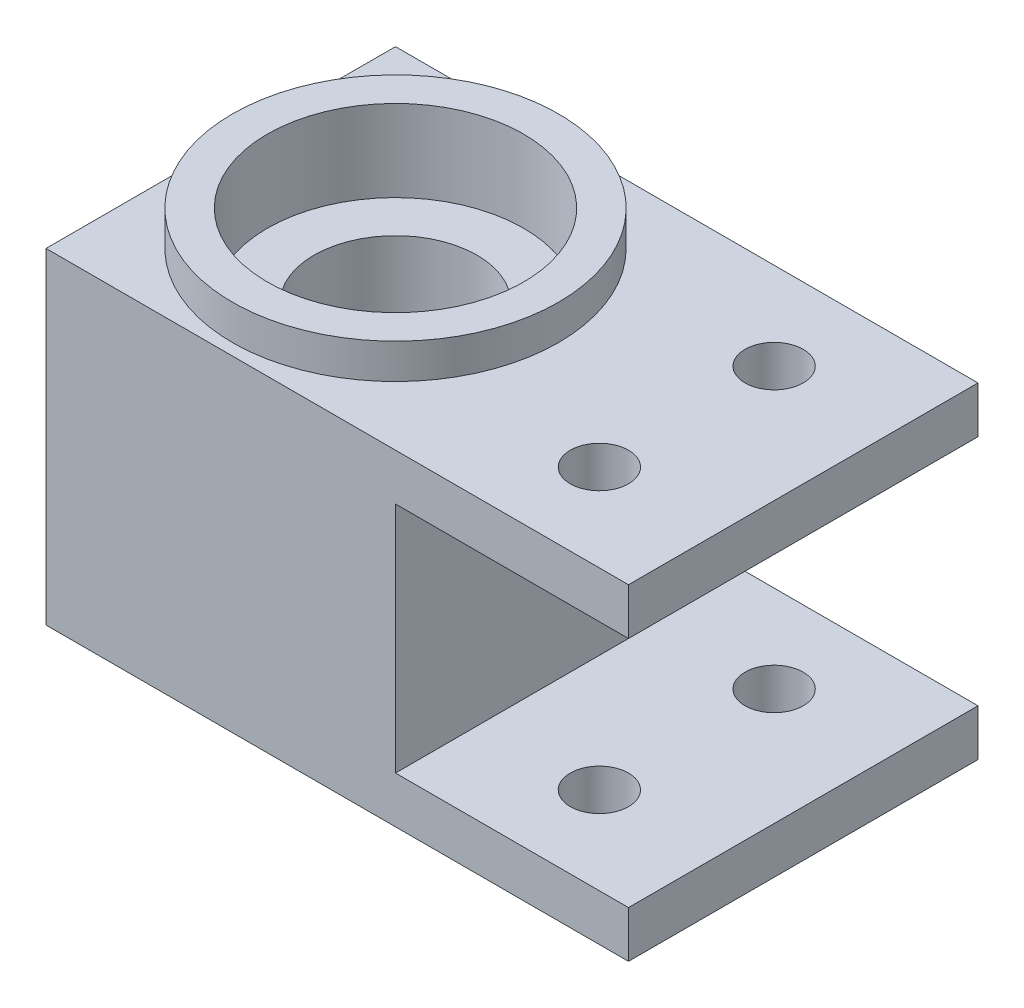
ISO-10303-21;
HEADER;
FILE_DESCRIPTION(('STEP AP214'),'2;1');
FILE_NAME('part.step','',(''),(''),'','','');
FILE_SCHEMA(('AUTOMOTIVE_DESIGN { 1 0 10303 214 1 1 1 1 }'));
ENDSEC;
DATA;
#1=APPLICATION_CONTEXT('core data for automotive mechanical design processes');
#2=APPLICATION_PROTOCOL_DEFINITION('international standard','automotive_design',2000,#1);
#3=PRODUCT_CONTEXT('',#1,'mechanical');
#4=PRODUCT('Part','Part','',(#3));
#5=PRODUCT_RELATED_PRODUCT_CATEGORY('part','',(#4));
#6=PRODUCT_DEFINITION_FORMATION('','',#4);
#7=PRODUCT_DEFINITION_CONTEXT('part definition',#1,'design');
#8=PRODUCT_DEFINITION('design','',#6,#7);
#9=PRODUCT_DEFINITION_SHAPE('','',#8);
#10=(LENGTH_UNIT() NAMED_UNIT(*) SI_UNIT(.MILLI.,.METRE.));
#11=(NAMED_UNIT(*) PLANE_ANGLE_UNIT() SI_UNIT($,.RADIAN.));
#12=(NAMED_UNIT(*) SI_UNIT($,.STERADIAN.) SOLID_ANGLE_UNIT());
#13=UNCERTAINTY_MEASURE_WITH_UNIT(LENGTH_MEASURE(1.E-05),#10,'distance_accuracy_value','');
#14=(GEOMETRIC_REPRESENTATION_CONTEXT(3) GLOBAL_UNCERTAINTY_ASSIGNED_CONTEXT((#13)) GLOBAL_UNIT_ASSIGNED_CONTEXT((#10,
#11,#12)) REPRESENTATION_CONTEXT('',''));
#15=CARTESIAN_POINT('',(0.,0.,0.));
#16=DIRECTION('',(0.,0.,1.));
#17=DIRECTION('',(1.,0.,0.));
#18=AXIS2_PLACEMENT_3D('',#15,#16,#17);
#19=CARTESIAN_POINT('',(10.,14.,30.));
#20=DIRECTION('',(0.,-1.,0.));
#21=DIRECTION('',(1.,0.,0.));
#22=AXIS2_PLACEMENT_3D('',#19,#20,#21);
#23=PLANE('',#22);
#24=DIRECTION('',(-1.,0.,0.));
#25=VECTOR('',#24,1.);
#26=CARTESIAN_POINT('',(10.,14.,0.));
#27=LINE('',#26,#25);
#28=CARTESIAN_POINT('',(10.,14.,0.));
#29=VERTEX_POINT('',#28);
#30=CARTESIAN_POINT('',(-40.,14.,0.));
#31=VERTEX_POINT('',#30);
#32=EDGE_CURVE('E136',#29,#31,#27,.T.);
#33=ORIENTED_EDGE('',*,*,#32,.T.);
#34=DIRECTION('',(0.,0.,-1.));
#35=VECTOR('',#34,1.);
#36=CARTESIAN_POINT('',(-40.,14.,30.));
#37=LINE('',#36,#35);
#38=CARTESIAN_POINT('',(-40.,14.,30.));
#39=VERTEX_POINT('',#38);
#40=EDGE_CURVE('E152',#39,#31,#37,.T.);
#41=ORIENTED_EDGE('',*,*,#40,.F.);
#42=DIRECTION('',(-1.,0.,0.));
#43=VECTOR('',#42,1.);
#44=CARTESIAN_POINT('',(10.,14.,30.));
#45=LINE('',#44,#43);
#46=CARTESIAN_POINT('',(10.,14.,30.));
#47=VERTEX_POINT('',#46);
#48=EDGE_CURVE('E194',#47,#39,#45,.T.);
#49=ORIENTED_EDGE('',*,*,#48,.F.);
#50=DIRECTION('',(0.,0.,-1.));
#51=VECTOR('',#50,1.);
#52=CARTESIAN_POINT('',(10.,14.,30.));
#53=LINE('',#52,#51);
#54=EDGE_CURVE('E155',#47,#29,#53,.T.);
#55=ORIENTED_EDGE('',*,*,#54,.T.);
#56=EDGE_LOOP('',(#33,#41,#49,#55));
#57=FACE_BOUND('',#56,.T.);
#58=CARTESIAN_POINT('',(0.,14.,7.5));
#59=DIRECTION('',(0.,1.,0.));
#60=DIRECTION('',(-1.,0.,0.));
#61=AXIS2_PLACEMENT_3D('',#58,#59,#60);
#62=CIRCLE('',#61,2.5);
#63=CARTESIAN_POINT('',(-2.5,14.,7.5));
#64=VERTEX_POINT('',#63);
#65=EDGE_CURVE('E279',#64,#64,#62,.T.);
#66=ORIENTED_EDGE('',*,*,#65,.F.);
#67=EDGE_LOOP('',(#66));
#68=FACE_BOUND('',#67,.T.);
#69=CARTESIAN_POINT('',(0.,14.,22.5));
#70=DIRECTION('',(0.,1.,0.));
#71=DIRECTION('',(-1.,0.,0.));
#72=AXIS2_PLACEMENT_3D('',#69,#70,#71);
#73=CIRCLE('',#72,2.5);
#74=CARTESIAN_POINT('',(-2.5,14.,22.5));
#75=VERTEX_POINT('',#74);
#76=EDGE_CURVE('E277',#75,#75,#73,.T.);
#77=ORIENTED_EDGE('',*,*,#76,.F.);
#78=EDGE_LOOP('',(#77));
#79=FACE_BOUND('',#78,.T.);
#80=CARTESIAN_POINT('',(-25.,14.,15.));
#81=DIRECTION('',(0.,-1.,0.));
#82=DIRECTION('',(1.,0.,0.));
#83=AXIS2_PLACEMENT_3D('',#80,#81,#82);
#84=CIRCLE('',#83,14.);
#85=CARTESIAN_POINT('',(-11.,14.,15.));
#86=VERTEX_POINT('',#85);
#87=EDGE_CURVE('E11',#86,#86,#84,.F.);
#88=ORIENTED_EDGE('',*,*,#87,.F.);
#89=EDGE_LOOP('',(#88));
#90=FACE_BOUND('',#89,.T.);
#91=ADVANCED_FACE('F32',(#57,#68,#79,#90),#23,.F.);
#92=CARTESIAN_POINT('',(-25.,-14.,15.));
#93=DIRECTION('',(0.,1.,0.));
#94=DIRECTION('',(0.,0.,1.));
#95=AXIS2_PLACEMENT_3D('',#92,#93,#94);
#96=CYLINDRICAL_SURFACE('',#95,7.);
#97=CARTESIAN_POINT('',(-25.,10.,15.));
#98=DIRECTION('',(0.,1.,0.));
#99=DIRECTION('',(-1.,0.,0.));
#100=AXIS2_PLACEMENT_3D('',#97,#98,#99);
#101=CIRCLE('',#100,7.);
#102=CARTESIAN_POINT('',(-32.,10.,15.));
#103=VERTEX_POINT('',#102);
#104=EDGE_CURVE('E134',#103,#103,#101,.F.);
#105=ORIENTED_EDGE('',*,*,#104,.F.);
#106=EDGE_LOOP('',(#105));
#107=FACE_BOUND('',#106,.T.);
#108=CARTESIAN_POINT('',(-25.,-7.,15.));
#109=DIRECTION('',(0.,-1.,0.));
#110=DIRECTION('',(1.,0.,0.));
#111=AXIS2_PLACEMENT_3D('',#108,#109,#110);
#112=CIRCLE('',#111,7.);
#113=CARTESIAN_POINT('',(-18.,-7.,15.));
#114=VERTEX_POINT('',#113);
#115=EDGE_CURVE('E162',#114,#114,#112,.F.);
#116=ORIENTED_EDGE('',*,*,#115,.F.);
#117=EDGE_LOOP('',(#116));
#118=FACE_BOUND('',#117,.T.);
#119=ADVANCED_FACE('F225',(#107,#118),#96,.F.);
#120=CARTESIAN_POINT('',(-10.,10.,30.));
#121=DIRECTION('',(0.,1.,0.));
#122=DIRECTION('',(-1.,0.,0.));
#123=AXIS2_PLACEMENT_3D('',#120,#121,#122);
#124=PLANE('',#123);
#125=CARTESIAN_POINT('',(0.,10.,22.5));
#126=DIRECTION('',(0.,1.,0.));
#127=DIRECTION('',(-1.,0.,0.));
#128=AXIS2_PLACEMENT_3D('',#125,#126,#127);
#129=CIRCLE('',#128,2.5);
#130=CARTESIAN_POINT('',(-2.5,10.,22.5));
#131=VERTEX_POINT('',#130);
#132=EDGE_CURVE('E172',#131,#131,#129,.T.);
#133=ORIENTED_EDGE('',*,*,#132,.T.);
#134=EDGE_LOOP('',(#133));
#135=FACE_BOUND('',#134,.T.);
#136=CARTESIAN_POINT('',(0.,10.,7.5));
#137=DIRECTION('',(0.,1.,0.));
#138=DIRECTION('',(-1.,0.,0.));
#139=AXIS2_PLACEMENT_3D('',#136,#137,#138);
#140=CIRCLE('',#139,2.5);
#141=CARTESIAN_POINT('',(-2.5,10.,7.5));
#142=VERTEX_POINT('',#141);
#143=EDGE_CURVE('E168',#142,#142,#140,.T.);
#144=ORIENTED_EDGE('',*,*,#143,.T.);
#145=EDGE_LOOP('',(#144));
#146=FACE_BOUND('',#145,.T.);
#147=DIRECTION('',(1.,0.,0.));
#148=VECTOR('',#147,1.);
#149=CARTESIAN_POINT('',(-10.,10.,0.));
#150=LINE('',#149,#148);
#151=CARTESIAN_POINT('',(-10.,10.,0.));
#152=VERTEX_POINT('',#151);
#153=CARTESIAN_POINT('',(10.,10.,0.));
#154=VERTEX_POINT('',#153);
#155=EDGE_CURVE('E130',#152,#154,#150,.T.);
#156=ORIENTED_EDGE('',*,*,#155,.T.);
#157=DIRECTION('',(0.,0.,-1.));
#158=VECTOR('',#157,1.);
#159=CARTESIAN_POINT('',(10.,10.,30.));
#160=LINE('',#159,#158);
#161=CARTESIAN_POINT('',(10.,10.,30.));
#162=VERTEX_POINT('',#161);
#163=EDGE_CURVE('E41',#162,#154,#160,.T.);
#164=ORIENTED_EDGE('',*,*,#163,.F.);
#165=DIRECTION('',(1.,0.,0.));
#166=VECTOR('',#165,1.);
#167=CARTESIAN_POINT('',(-10.,10.,30.));
#168=LINE('',#167,#166);
#169=CARTESIAN_POINT('',(-10.,10.,30.));
#170=VERTEX_POINT('',#169);
#171=EDGE_CURVE('E145',#170,#162,#168,.T.);
#172=ORIENTED_EDGE('',*,*,#171,.F.);
#173=DIRECTION('',(0.,0.,-1.));
#174=VECTOR('',#173,1.);
#175=CARTESIAN_POINT('',(-10.,10.,30.));
#176=LINE('',#175,#174);
#177=EDGE_CURVE('E126',#170,#152,#176,.T.);
#178=ORIENTED_EDGE('',*,*,#177,.T.);
#179=EDGE_LOOP('',(#156,#164,#172,#178));
#180=FACE_BOUND('',#179,.T.);
#181=ADVANCED_FACE('F34',(#135,#146,#180),#124,.F.);
#182=CARTESIAN_POINT('',(10.,10.,30.));
#183=DIRECTION('',(-1.,0.,0.));
#184=DIRECTION('',(0.,0.,1.));
#185=AXIS2_PLACEMENT_3D('',#182,#183,#184);
#186=PLANE('',#185);
#187=DIRECTION('',(0.,1.,0.));
#188=VECTOR('',#187,1.);
#189=CARTESIAN_POINT('',(10.,10.,0.));
#190=LINE('',#189,#188);
#191=EDGE_CURVE('E133',#154,#29,#190,.T.);
#192=ORIENTED_EDGE('',*,*,#191,.T.);
#193=ORIENTED_EDGE('',*,*,#54,.F.);
#194=DIRECTION('',(0.,1.,0.));
#195=VECTOR('',#194,1.);
#196=CARTESIAN_POINT('',(10.,10.,30.));
#197=LINE('',#196,#195);
#198=EDGE_CURVE('E93',#162,#47,#197,.T.);
#199=ORIENTED_EDGE('',*,*,#198,.F.);
#200=ORIENTED_EDGE('',*,*,#163,.T.);
#201=EDGE_LOOP('',(#192,#193,#199,#200));
#202=FACE_BOUND('',#201,.T.);
#203=ADVANCED_FACE('F236',(#202),#186,.F.);
#204=CARTESIAN_POINT('',(-40.,14.,30.));
#205=DIRECTION('',(1.,0.,0.));
#206=DIRECTION('',(0.,1.,0.));
#207=AXIS2_PLACEMENT_3D('',#204,#205,#206);
#208=PLANE('',#207);
#209=DIRECTION('',(0.,-1.,0.));
#210=VECTOR('',#209,1.);
#211=CARTESIAN_POINT('',(-40.,14.,0.));
#212=LINE('',#211,#210);
#213=CARTESIAN_POINT('',(-40.,-14.,0.));
#214=VERTEX_POINT('',#213);
#215=EDGE_CURVE('E138',#31,#214,#212,.T.);
#216=ORIENTED_EDGE('',*,*,#215,.T.);
#217=DIRECTION('',(0.,0.,-1.));
#218=VECTOR('',#217,1.);
#219=CARTESIAN_POINT('',(-40.,-14.,30.));
#220=LINE('',#219,#218);
#221=CARTESIAN_POINT('',(-40.,-14.,30.));
#222=VERTEX_POINT('',#221);
#223=EDGE_CURVE('E149',#222,#214,#220,.T.);
#224=ORIENTED_EDGE('',*,*,#223,.F.);
#225=DIRECTION('',(0.,-1.,0.));
#226=VECTOR('',#225,1.);
#227=CARTESIAN_POINT('',(-40.,14.,30.));
#228=LINE('',#227,#226);
#229=EDGE_CURVE('E196',#39,#222,#228,.T.);
#230=ORIENTED_EDGE('',*,*,#229,.F.);
#231=ORIENTED_EDGE('',*,*,#40,.T.);
#232=EDGE_LOOP('',(#216,#224,#230,#231));
#233=FACE_BOUND('',#232,.T.);
#234=ADVANCED_FACE('F202',(#233),#208,.F.);
#235=CARTESIAN_POINT('',(-40.,-14.,30.));
#236=DIRECTION('',(0.,1.,0.));
#237=DIRECTION('',(0.,0.,1.));
#238=AXIS2_PLACEMENT_3D('',#235,#236,#237);
#239=PLANE('',#238);
#240=CARTESIAN_POINT('',(0.,-14.,22.5));
#241=DIRECTION('',(0.,1.,0.));
#242=DIRECTION('',(-1.,0.,0.));
#243=AXIS2_PLACEMENT_3D('',#240,#241,#242);
#244=CIRCLE('',#243,2.5);
#245=CARTESIAN_POINT('',(-2.5,-14.,22.5));
#246=VERTEX_POINT('',#245);
#247=EDGE_CURVE('E169',#246,#246,#244,.T.);
#248=ORIENTED_EDGE('',*,*,#247,.T.);
#249=EDGE_LOOP('',(#248));
#250=FACE_BOUND('',#249,.T.);
#251=CARTESIAN_POINT('',(0.,-14.,7.5));
#252=DIRECTION('',(0.,1.,0.));
#253=DIRECTION('',(-1.,0.,0.));
#254=AXIS2_PLACEMENT_3D('',#251,#252,#253);
#255=CIRCLE('',#254,2.5);
#256=CARTESIAN_POINT('',(-2.5,-14.,7.5));
#257=VERTEX_POINT('',#256);
#258=EDGE_CURVE('E183',#257,#257,#255,.T.);
#259=ORIENTED_EDGE('',*,*,#258,.T.);
#260=EDGE_LOOP('',(#259));
#261=FACE_BOUND('',#260,.T.);
#262=CARTESIAN_POINT('',(-25.,-14.,15.));
#263=DIRECTION('',(0.,-1.,0.));
#264=DIRECTION('',(1.,0.,0.));
#265=AXIS2_PLACEMENT_3D('',#262,#263,#264);
#266=CIRCLE('',#265,11.);
#267=CARTESIAN_POINT('',(-14.,-14.,15.));
#268=VERTEX_POINT('',#267);
#269=EDGE_CURVE('E176',#268,#268,#266,.T.);
#270=ORIENTED_EDGE('',*,*,#269,.F.);
#271=EDGE_LOOP('',(#270));
#272=FACE_BOUND('',#271,.T.);
#273=DIRECTION('',(1.,0.,0.));
#274=VECTOR('',#273,1.);
#275=CARTESIAN_POINT('',(-40.,-14.,0.));
#276=LINE('',#275,#274);
#277=CARTESIAN_POINT('',(10.,-14.,0.));
#278=VERTEX_POINT('',#277);
#279=EDGE_CURVE('E140',#214,#278,#276,.T.);
#280=ORIENTED_EDGE('',*,*,#279,.T.);
#281=DIRECTION('',(0.,0.,-1.));
#282=VECTOR('',#281,1.);
#283=CARTESIAN_POINT('',(10.,-14.,30.));
#284=LINE('',#283,#282);
#285=CARTESIAN_POINT('',(10.,-14.,30.));
#286=VERTEX_POINT('',#285);
#287=EDGE_CURVE('E121',#286,#278,#284,.T.);
#288=ORIENTED_EDGE('',*,*,#287,.F.);
#289=DIRECTION('',(1.,0.,0.));
#290=VECTOR('',#289,1.);
#291=CARTESIAN_POINT('',(-40.,-14.,30.));
#292=LINE('',#291,#290);
#293=EDGE_CURVE('E112',#222,#286,#292,.T.);
#294=ORIENTED_EDGE('',*,*,#293,.F.);
#295=ORIENTED_EDGE('',*,*,#223,.T.);
#296=EDGE_LOOP('',(#280,#288,#294,#295));
#297=FACE_BOUND('',#296,.T.);
#298=ADVANCED_FACE('F206',(#250,#261,#272,#297),#239,.F.);
#299=CARTESIAN_POINT('',(10.,-14.,30.));
#300=DIRECTION('',(-1.,0.,0.));
#301=DIRECTION('',(0.,0.,1.));
#302=AXIS2_PLACEMENT_3D('',#299,#300,#301);
#303=PLANE('',#302);
#304=DIRECTION('',(0.,1.,0.));
#305=VECTOR('',#304,1.);
#306=CARTESIAN_POINT('',(10.,-14.,0.));
#307=LINE('',#306,#305);
#308=CARTESIAN_POINT('',(10.,-10.,0.));
#309=VERTEX_POINT('',#308);
#310=EDGE_CURVE('E120',#278,#309,#307,.T.);
#311=ORIENTED_EDGE('',*,*,#310,.T.);
#312=DIRECTION('',(0.,0.,-1.));
#313=VECTOR('',#312,1.);
#314=CARTESIAN_POINT('',(10.,-10.,30.));
#315=LINE('',#314,#313);
#316=CARTESIAN_POINT('',(10.,-10.,30.));
#317=VERTEX_POINT('',#316);
#318=EDGE_CURVE('E117',#317,#309,#315,.T.);
#319=ORIENTED_EDGE('',*,*,#318,.F.);
#320=DIRECTION('',(0.,1.,0.));
#321=VECTOR('',#320,1.);
#322=CARTESIAN_POINT('',(10.,-14.,30.));
#323=LINE('',#322,#321);
#324=EDGE_CURVE('E106',#286,#317,#323,.T.);
#325=ORIENTED_EDGE('',*,*,#324,.F.);
#326=ORIENTED_EDGE('',*,*,#287,.T.);
#327=EDGE_LOOP('',(#311,#319,#325,#326));
#328=FACE_BOUND('',#327,.T.);
#329=ADVANCED_FACE('F118',(#328),#303,.F.);
#330=CARTESIAN_POINT('',(-10.,-10.,30.));
#331=DIRECTION('',(0.,-1.,0.));
#332=DIRECTION('',(0.,0.,-1.));
#333=AXIS2_PLACEMENT_3D('',#330,#331,#332);
#334=PLANE('',#333);
#335=CARTESIAN_POINT('',(0.,-10.,22.5));
#336=DIRECTION('',(0.,-1.,0.));
#337=DIRECTION('',(0.,0.,-1.));
#338=AXIS2_PLACEMENT_3D('',#335,#336,#337);
#339=CIRCLE('',#338,2.5);
#340=CARTESIAN_POINT('',(0.,-10.,20.));
#341=VERTEX_POINT('',#340);
#342=EDGE_CURVE('E170',#341,#341,#339,.T.);
#343=ORIENTED_EDGE('',*,*,#342,.T.);
#344=EDGE_LOOP('',(#343));
#345=FACE_BOUND('',#344,.T.);
#346=CARTESIAN_POINT('',(0.,-10.,7.5));
#347=DIRECTION('',(0.,-1.,0.));
#348=DIRECTION('',(0.,0.,-1.));
#349=AXIS2_PLACEMENT_3D('',#346,#347,#348);
#350=CIRCLE('',#349,2.5);
#351=CARTESIAN_POINT('',(0.,-10.,5.));
#352=VERTEX_POINT('',#351);
#353=EDGE_CURVE('E166',#352,#352,#350,.T.);
#354=ORIENTED_EDGE('',*,*,#353,.T.);
#355=EDGE_LOOP('',(#354));
#356=FACE_BOUND('',#355,.T.);
#357=DIRECTION('',(-1.,0.,0.));
#358=VECTOR('',#357,1.);
#359=CARTESIAN_POINT('',(-10.,-10.,0.));
#360=LINE('',#359,#358);
#361=CARTESIAN_POINT('',(-10.,-10.,0.));
#362=VERTEX_POINT('',#361);
#363=EDGE_CURVE('E78',#309,#362,#360,.T.);
#364=ORIENTED_EDGE('',*,*,#363,.T.);
#365=DIRECTION('',(0.,0.,-1.));
#366=VECTOR('',#365,1.);
#367=CARTESIAN_POINT('',(-10.,-10.,30.));
#368=LINE('',#367,#366);
#369=CARTESIAN_POINT('',(-10.,-10.,30.));
#370=VERTEX_POINT('',#369);
#371=EDGE_CURVE('E122',#370,#362,#368,.T.);
#372=ORIENTED_EDGE('',*,*,#371,.F.);
#373=DIRECTION('',(-1.,0.,0.));
#374=VECTOR('',#373,1.);
#375=CARTESIAN_POINT('',(-10.,-10.,30.));
#376=LINE('',#375,#374);
#377=EDGE_CURVE('E110',#317,#370,#376,.T.);
#378=ORIENTED_EDGE('',*,*,#377,.F.);
#379=ORIENTED_EDGE('',*,*,#318,.T.);
#380=EDGE_LOOP('',(#364,#372,#378,#379));
#381=FACE_BOUND('',#380,.T.);
#382=ADVANCED_FACE('F124',(#345,#356,#381),#334,.F.);
#383=CARTESIAN_POINT('',(-10.,-10.,30.));
#384=DIRECTION('',(-1.,0.,0.));
#385=DIRECTION('',(0.,0.,1.));
#386=AXIS2_PLACEMENT_3D('',#383,#384,#385);
#387=PLANE('',#386);
#388=DIRECTION('',(0.,1.,0.));
#389=VECTOR('',#388,1.);
#390=CARTESIAN_POINT('',(-10.,-10.,0.));
#391=LINE('',#390,#389);
#392=EDGE_CURVE('E84',#362,#152,#391,.T.);
#393=ORIENTED_EDGE('',*,*,#392,.T.);
#394=ORIENTED_EDGE('',*,*,#177,.F.);
#395=DIRECTION('',(0.,1.,0.));
#396=VECTOR('',#395,1.);
#397=CARTESIAN_POINT('',(-10.,-10.,30.));
#398=LINE('',#397,#396);
#399=EDGE_CURVE('E49',#370,#170,#398,.T.);
#400=ORIENTED_EDGE('',*,*,#399,.F.);
#401=ORIENTED_EDGE('',*,*,#371,.T.);
#402=EDGE_LOOP('',(#393,#394,#400,#401));
#403=FACE_BOUND('',#402,.T.);
#404=ADVANCED_FACE('F214',(#403),#387,.F.);
#405=CARTESIAN_POINT('',(0.,0.,30.));
#406=DIRECTION('',(0.,0.,1.));
#407=DIRECTION('',(1.,0.,0.));
#408=AXIS2_PLACEMENT_3D('',#405,#406,#407);
#409=PLANE('',#408);
#410=ORIENTED_EDGE('',*,*,#171,.T.);
#411=ORIENTED_EDGE('',*,*,#198,.T.);
#412=ORIENTED_EDGE('',*,*,#48,.T.);
#413=ORIENTED_EDGE('',*,*,#229,.T.);
#414=ORIENTED_EDGE('',*,*,#293,.T.);
#415=ORIENTED_EDGE('',*,*,#324,.T.);
#416=ORIENTED_EDGE('',*,*,#377,.T.);
#417=ORIENTED_EDGE('',*,*,#399,.T.);
#418=EDGE_LOOP('',(#410,#411,#412,#413,#414,#415,#416,#417));
#419=FACE_BOUND('',#418,.T.);
#420=ADVANCED_FACE('F108',(#419),#409,.T.);
#421=CARTESIAN_POINT('',(0.,0.,0.));
#422=DIRECTION('',(0.,0.,1.));
#423=DIRECTION('',(1.,0.,0.));
#424=AXIS2_PLACEMENT_3D('',#421,#422,#423);
#425=PLANE('',#424);
#426=ORIENTED_EDGE('',*,*,#155,.F.);
#427=ORIENTED_EDGE('',*,*,#392,.F.);
#428=ORIENTED_EDGE('',*,*,#363,.F.);
#429=ORIENTED_EDGE('',*,*,#310,.F.);
#430=ORIENTED_EDGE('',*,*,#279,.F.);
#431=ORIENTED_EDGE('',*,*,#215,.F.);
#432=ORIENTED_EDGE('',*,*,#32,.F.);
#433=ORIENTED_EDGE('',*,*,#191,.F.);
#434=EDGE_LOOP('',(#426,#427,#428,#429,#430,#431,#432,#433));
#435=FACE_BOUND('',#434,.T.);
#436=ADVANCED_FACE('F209',(#435),#425,.F.);
#437=CARTESIAN_POINT('',(-25.,10.,15.));
#438=DIRECTION('',(0.,1.,0.));
#439=DIRECTION('',(-1.,0.,0.));
#440=AXIS2_PLACEMENT_3D('',#437,#438,#439);
#441=PLANE('',#440);
#442=CARTESIAN_POINT('',(-25.,10.,15.));
#443=DIRECTION('',(0.,1.,0.));
#444=DIRECTION('',(-1.,0.,0.));
#445=AXIS2_PLACEMENT_3D('',#442,#443,#444);
#446=CIRCLE('',#445,11.);
#447=CARTESIAN_POINT('',(-36.,10.,15.));
#448=VERTEX_POINT('',#447);
#449=EDGE_CURVE('E161',#448,#448,#446,.T.);
#450=ORIENTED_EDGE('',*,*,#449,.T.);
#451=EDGE_LOOP('',(#450));
#452=FACE_BOUND('',#451,.T.);
#453=ORIENTED_EDGE('',*,*,#104,.T.);
#454=EDGE_LOOP('',(#453));
#455=FACE_BOUND('',#454,.T.);
#456=ADVANCED_FACE('F299',(#452,#455),#441,.T.);
#457=CARTESIAN_POINT('',(-25.,10.,15.));
#458=DIRECTION('',(0.,1.,0.));
#459=DIRECTION('',(-1.,0.,0.));
#460=AXIS2_PLACEMENT_3D('',#457,#458,#459);
#461=CYLINDRICAL_SURFACE('',#460,11.);
#462=ORIENTED_EDGE('',*,*,#449,.F.);
#463=EDGE_LOOP('',(#462));
#464=FACE_BOUND('',#463,.T.);
#465=CARTESIAN_POINT('',(-25.,17.,15.));
#466=DIRECTION('',(0.,1.,0.));
#467=DIRECTION('',(-1.,0.,0.));
#468=AXIS2_PLACEMENT_3D('',#465,#466,#467);
#469=CIRCLE('',#468,11.);
#470=CARTESIAN_POINT('',(-36.,17.,15.));
#471=VERTEX_POINT('',#470);
#472=EDGE_CURVE('E290',#471,#471,#469,.T.);
#473=ORIENTED_EDGE('',*,*,#472,.T.);
#474=EDGE_LOOP('',(#473));
#475=FACE_BOUND('',#474,.T.);
#476=ADVANCED_FACE('F295',(#464,#475),#461,.F.);
#477=CARTESIAN_POINT('',(-25.,-7.,15.));
#478=DIRECTION('',(0.,-1.,0.));
#479=DIRECTION('',(1.,0.,0.));
#480=AXIS2_PLACEMENT_3D('',#477,#478,#479);
#481=PLANE('',#480);
#482=CARTESIAN_POINT('',(-25.,-7.,15.));
#483=DIRECTION('',(0.,-1.,0.));
#484=DIRECTION('',(1.,0.,0.));
#485=AXIS2_PLACEMENT_3D('',#482,#483,#484);
#486=CIRCLE('',#485,11.);
#487=CARTESIAN_POINT('',(-14.,-7.,15.));
#488=VERTEX_POINT('',#487);
#489=EDGE_CURVE('E165',#488,#488,#486,.T.);
#490=ORIENTED_EDGE('',*,*,#489,.T.);
#491=EDGE_LOOP('',(#490));
#492=FACE_BOUND('',#491,.T.);
#493=ORIENTED_EDGE('',*,*,#115,.T.);
#494=EDGE_LOOP('',(#493));
#495=FACE_BOUND('',#494,.T.);
#496=ADVANCED_FACE('F298',(#492,#495),#481,.T.);
#497=CARTESIAN_POINT('',(-25.,-7.,15.));
#498=DIRECTION('',(0.,-1.,0.));
#499=DIRECTION('',(1.,0.,0.));
#500=AXIS2_PLACEMENT_3D('',#497,#498,#499);
#501=CYLINDRICAL_SURFACE('',#500,11.);
#502=ORIENTED_EDGE('',*,*,#489,.F.);
#503=EDGE_LOOP('',(#502));
#504=FACE_BOUND('',#503,.T.);
#505=ORIENTED_EDGE('',*,*,#269,.T.);
#506=EDGE_LOOP('',(#505));
#507=FACE_BOUND('',#506,.T.);
#508=ADVANCED_FACE('F271',(#504,#507),#501,.F.);
#509=CARTESIAN_POINT('',(0.,-14.,7.5));
#510=DIRECTION('',(0.,1.,0.));
#511=DIRECTION('',(-1.,0.,0.));
#512=AXIS2_PLACEMENT_3D('',#509,#510,#511);
#513=CYLINDRICAL_SURFACE('',#512,2.5);
#514=ORIENTED_EDGE('',*,*,#258,.F.);
#515=EDGE_LOOP('',(#514));
#516=FACE_BOUND('',#515,.T.);
#517=ORIENTED_EDGE('',*,*,#353,.F.);
#518=EDGE_LOOP('',(#517));
#519=FACE_BOUND('',#518,.T.);
#520=ADVANCED_FACE('F263',(#516,#519),#513,.F.);
#521=CARTESIAN_POINT('',(0.,-14.,22.5));
#522=DIRECTION('',(0.,1.,0.));
#523=DIRECTION('',(-1.,0.,0.));
#524=AXIS2_PLACEMENT_3D('',#521,#522,#523);
#525=CYLINDRICAL_SURFACE('',#524,2.5);
#526=ORIENTED_EDGE('',*,*,#247,.F.);
#527=EDGE_LOOP('',(#526));
#528=FACE_BOUND('',#527,.T.);
#529=ORIENTED_EDGE('',*,*,#342,.F.);
#530=EDGE_LOOP('',(#529));
#531=FACE_BOUND('',#530,.T.);
#532=ADVANCED_FACE('F253',(#528,#531),#525,.F.);
#533=ORIENTED_EDGE('',*,*,#65,.T.);
#534=EDGE_LOOP('',(#533));
#535=FACE_BOUND('',#534,.T.);
#536=ORIENTED_EDGE('',*,*,#143,.F.);
#537=EDGE_LOOP('',(#536));
#538=FACE_BOUND('',#537,.T.);
#539=ADVANCED_FACE('F250',(#535,#538),#513,.F.);
#540=ORIENTED_EDGE('',*,*,#76,.T.);
#541=EDGE_LOOP('',(#540));
#542=FACE_BOUND('',#541,.T.);
#543=ORIENTED_EDGE('',*,*,#132,.F.);
#544=EDGE_LOOP('',(#543));
#545=FACE_BOUND('',#544,.T.);
#546=ADVANCED_FACE('F247',(#542,#545),#525,.F.);
#547=CARTESIAN_POINT('',(-25.,17.,15.));
#548=DIRECTION('',(0.,1.,0.));
#549=DIRECTION('',(-1.,0.,0.));
#550=AXIS2_PLACEMENT_3D('',#547,#548,#549);
#551=PLANE('',#550);
#552=CARTESIAN_POINT('',(-25.,17.,15.));
#553=DIRECTION('',(0.,1.,0.));
#554=DIRECTION('',(-1.,0.,0.));
#555=AXIS2_PLACEMENT_3D('',#552,#553,#554);
#556=CIRCLE('',#555,14.);
#557=CARTESIAN_POINT('',(-39.,17.,15.));
#558=VERTEX_POINT('',#557);
#559=EDGE_CURVE('E282',#558,#558,#556,.T.);
#560=ORIENTED_EDGE('',*,*,#559,.T.);
#561=EDGE_LOOP('',(#560));
#562=FACE_BOUND('',#561,.T.);
#563=ORIENTED_EDGE('',*,*,#472,.F.);
#564=EDGE_LOOP('',(#563));
#565=FACE_BOUND('',#564,.T.);
#566=ADVANCED_FACE('F249',(#562,#565),#551,.T.);
#567=CARTESIAN_POINT('',(-25.,17.,15.));
#568=DIRECTION('',(0.,-1.,0.));
#569=DIRECTION('',(1.,0.,0.));
#570=AXIS2_PLACEMENT_3D('',#567,#568,#569);
#571=CYLINDRICAL_SURFACE('',#570,14.);
#572=ORIENTED_EDGE('',*,*,#559,.F.);
#573=EDGE_LOOP('',(#572));
#574=FACE_BOUND('',#573,.T.);
#575=ORIENTED_EDGE('',*,*,#87,.T.);
#576=EDGE_LOOP('',(#575));
#577=FACE_BOUND('',#576,.T.);
#578=ADVANCED_FACE('F258',(#574,#577),#571,.T.);
#579=CLOSED_SHELL('',(#91,#119,#181,#203,#234,#298,#329,#382,#404,#420,#436,#456,#476,#496,#508,
#520,#532,#539,#546,#566,#578));
#580=MANIFOLD_SOLID_BREP('B2',#579);
#581=ADVANCED_BREP_SHAPE_REPRESENTATION('',(#18,#580),#14);
#582=SHAPE_DEFINITION_REPRESENTATION(#9,#581);
ENDSEC;
END-ISO-10303-21;
